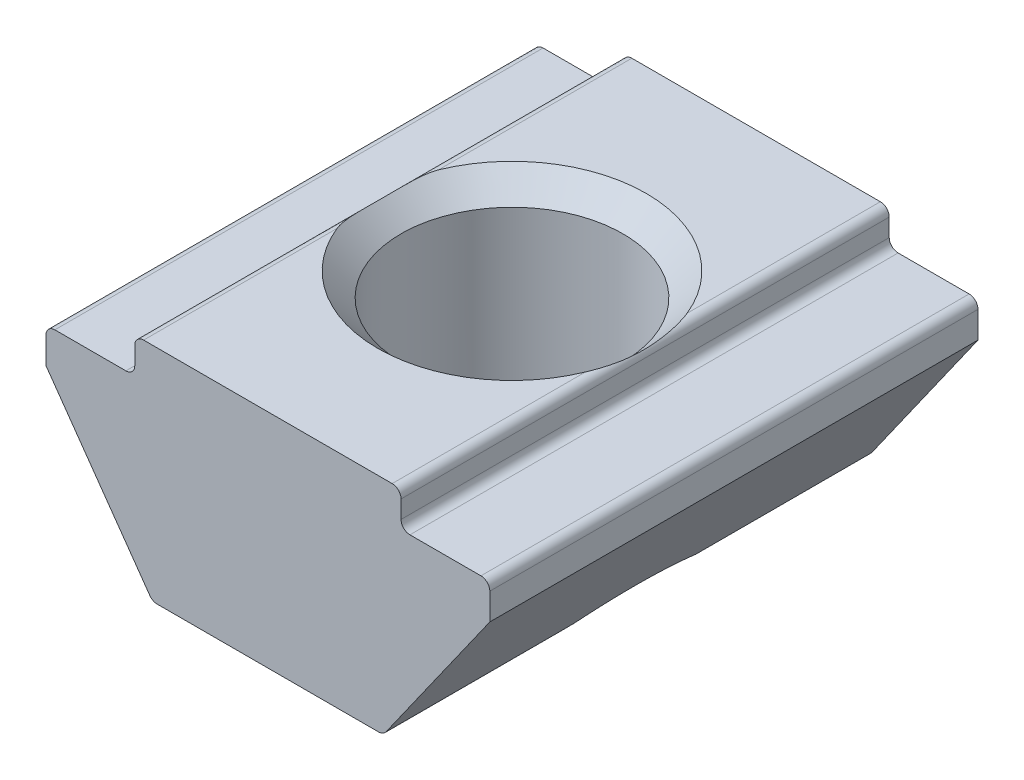
ISO-10303-21;
HEADER;
FILE_DESCRIPTION(('STEP AP214'),'2;1');
FILE_NAME('part.step','',(''),(''),'','','');
FILE_SCHEMA(('AUTOMOTIVE_DESIGN { 1 0 10303 214 1 1 1 1 }'));
ENDSEC;
DATA;
#1=APPLICATION_CONTEXT('core data for automotive mechanical design processes');
#2=APPLICATION_PROTOCOL_DEFINITION('international standard','automotive_design',2000,#1);
#3=PRODUCT_CONTEXT('',#1,'mechanical');
#4=PRODUCT('Part','Part','',(#3));
#5=PRODUCT_RELATED_PRODUCT_CATEGORY('part','',(#4));
#6=PRODUCT_DEFINITION_FORMATION('','',#4);
#7=PRODUCT_DEFINITION_CONTEXT('part definition',#1,'design');
#8=PRODUCT_DEFINITION('design','',#6,#7);
#9=PRODUCT_DEFINITION_SHAPE('','',#8);
#10=(LENGTH_UNIT() NAMED_UNIT(*) SI_UNIT(.MILLI.,.METRE.));
#11=(NAMED_UNIT(*) PLANE_ANGLE_UNIT() SI_UNIT($,.RADIAN.));
#12=(NAMED_UNIT(*) SI_UNIT($,.STERADIAN.) SOLID_ANGLE_UNIT());
#13=UNCERTAINTY_MEASURE_WITH_UNIT(LENGTH_MEASURE(1.E-05),#10,'distance_accuracy_value','');
#14=(GEOMETRIC_REPRESENTATION_CONTEXT(3) GLOBAL_UNCERTAINTY_ASSIGNED_CONTEXT((#13)) GLOBAL_UNIT_ASSIGNED_CONTEXT((#10,
#11,#12)) REPRESENTATION_CONTEXT('',''));
#15=CARTESIAN_POINT('',(0.,0.,0.));
#16=DIRECTION('',(0.,0.,1.));
#17=DIRECTION('',(1.,0.,0.));
#18=AXIS2_PLACEMENT_3D('',#15,#16,#17);
#19=CARTESIAN_POINT('',(-2.6,-5.,5.5));
#20=DIRECTION('',(0.,1.,0.));
#21=DIRECTION('',(0.,0.,1.));
#22=AXIS2_PLACEMENT_3D('',#19,#20,#21);
#23=PLANE('',#22);
#24=DIRECTION('',(0.,0.,-1.));
#25=VECTOR('',#24,1.);
#26=CARTESIAN_POINT('',(2.6,-5.,5.5));
#27=LINE('',#26,#25);
#28=CARTESIAN_POINT('',(2.6,-5.,-1.54616460960662));
#29=VERTEX_POINT('',#28);
#30=CARTESIAN_POINT('',(2.6,-5.,-5.5));
#31=VERTEX_POINT('',#30);
#32=EDGE_CURVE('E191',#29,#31,#27,.T.);
#33=ORIENTED_EDGE('',*,*,#32,.F.);
#34=CARTESIAN_POINT('',(0.,-5.,0.));
#35=DIRECTION('',(0.,1.,0.));
#36=DIRECTION('',(0.,0.,1.));
#37=AXIS2_PLACEMENT_3D('',#34,#35,#36);
#38=CIRCLE('',#37,3.025);
#39=CARTESIAN_POINT('',(-2.6,-5.,-1.54616460960662));
#40=VERTEX_POINT('',#39);
#41=EDGE_CURVE('E200',#29,#40,#38,.T.);
#42=ORIENTED_EDGE('',*,*,#41,.T.);
#43=DIRECTION('',(0.,0.,-1.));
#44=VECTOR('',#43,1.);
#45=CARTESIAN_POINT('',(-2.6,-5.,5.5));
#46=LINE('',#45,#44);
#47=CARTESIAN_POINT('',(-2.6,-5.,-5.5));
#48=VERTEX_POINT('',#47);
#49=EDGE_CURVE('E212',#40,#48,#46,.T.);
#50=ORIENTED_EDGE('',*,*,#49,.T.);
#51=DIRECTION('',(1.,0.,0.));
#52=VECTOR('',#51,1.);
#53=CARTESIAN_POINT('',(-2.6,-5.,-5.5));
#54=LINE('',#53,#52);
#55=EDGE_CURVE('E210',#48,#31,#54,.T.);
#56=ORIENTED_EDGE('',*,*,#55,.T.);
#57=EDGE_LOOP('',(#33,#42,#50,#56));
#58=FACE_BOUND('',#57,.T.);
#59=ADVANCED_FACE('F37',(#58),#23,.F.);
#60=CARTESIAN_POINT('',(3.00000000000001,0.,5.5));
#61=DIRECTION('',(0.,-1.,0.));
#62=DIRECTION('',(0.,0.,-1.));
#63=AXIS2_PLACEMENT_3D('',#60,#61,#62);
#64=PLANE('',#63);
#65=CARTESIAN_POINT('',(0.,0.,0.));
#66=DIRECTION('',(0.,1.,0.));
#67=DIRECTION('',(0.,0.,1.));
#68=AXIS2_PLACEMENT_3D('',#65,#66,#67);
#69=CIRCLE('',#68,3.025);
#70=CARTESIAN_POINT('',(2.8,0.,-1.14482531418552));
#71=VERTEX_POINT('',#70);
#72=CARTESIAN_POINT('',(-2.8,0.,-1.14482531418552));
#73=VERTEX_POINT('',#72);
#74=EDGE_CURVE('E232',#71,#73,#69,.T.);
#75=ORIENTED_EDGE('',*,*,#74,.F.);
#76=DIRECTION('',(0.,0.,-1.));
#77=VECTOR('',#76,1.);
#78=CARTESIAN_POINT('',(2.8,0.,-3.32241265709276));
#79=LINE('',#78,#77);
#80=CARTESIAN_POINT('',(2.8,0.,-5.5));
#81=VERTEX_POINT('',#80);
#82=EDGE_CURVE('E479',#71,#81,#79,.T.);
#83=ORIENTED_EDGE('',*,*,#82,.T.);
#84=DIRECTION('',(-1.,0.,0.));
#85=VECTOR('',#84,1.);
#86=CARTESIAN_POINT('',(3.00000000000001,0.,-5.5));
#87=LINE('',#86,#85);
#88=CARTESIAN_POINT('',(-2.8,0.,-5.5));
#89=VERTEX_POINT('',#88);
#90=EDGE_CURVE('E411',#81,#89,#87,.T.);
#91=ORIENTED_EDGE('',*,*,#90,.T.);
#92=DIRECTION('',(0.,0.,-1.));
#93=VECTOR('',#92,1.);
#94=CARTESIAN_POINT('',(-2.8,0.,-3.32241265709276));
#95=LINE('',#94,#93);
#96=EDGE_CURVE('E52',#89,#73,#95,.F.);
#97=ORIENTED_EDGE('',*,*,#96,.T.);
#98=EDGE_LOOP('',(#75,#83,#91,#97));
#99=FACE_BOUND('',#98,.T.);
#100=ADVANCED_FACE('F320',(#99),#64,.F.);
#101=DIRECTION('',(-1.,0.,0.));
#102=VECTOR('',#101,1.);
#103=CARTESIAN_POINT('',(3.00000000000001,0.,5.5));
#104=LINE('',#103,#102);
#105=CARTESIAN_POINT('',(2.8,0.,5.5));
#106=VERTEX_POINT('',#105);
#107=CARTESIAN_POINT('',(-2.8,0.,5.5));
#108=VERTEX_POINT('',#107);
#109=EDGE_CURVE('E218',#106,#108,#104,.T.);
#110=ORIENTED_EDGE('',*,*,#109,.F.);
#111=DIRECTION('',(0.,0.,-1.));
#112=VECTOR('',#111,1.);
#113=CARTESIAN_POINT('',(2.8,0.,5.5));
#114=LINE('',#113,#112);
#115=CARTESIAN_POINT('',(2.8,0.,1.14482531418552));
#116=VERTEX_POINT('',#115);
#117=EDGE_CURVE('E384',#106,#116,#114,.T.);
#118=ORIENTED_EDGE('',*,*,#117,.T.);
#119=CARTESIAN_POINT('',(-2.8,0.,1.14482531418552));
#120=VERTEX_POINT('',#119);
#121=EDGE_CURVE('E224',#120,#116,#69,.T.);
#122=ORIENTED_EDGE('',*,*,#121,.F.);
#123=DIRECTION('',(0.,0.,-1.));
#124=VECTOR('',#123,1.);
#125=CARTESIAN_POINT('',(-2.80000000000001,0.,5.5));
#126=LINE('',#125,#124);
#127=EDGE_CURVE('E383',#120,#108,#126,.F.);
#128=ORIENTED_EDGE('',*,*,#127,.T.);
#129=EDGE_LOOP('',(#110,#118,#122,#128));
#130=FACE_BOUND('',#129,.T.);
#131=ADVANCED_FACE('F325',(#130),#64,.F.);
#132=CARTESIAN_POINT('',(-3.00000000000001,0.,5.5));
#133=DIRECTION('',(1.,0.,0.));
#134=DIRECTION('',(0.,1.,0.));
#135=AXIS2_PLACEMENT_3D('',#132,#133,#134);
#136=PLANE('',#135);
#137=DIRECTION('',(0.,-1.,0.));
#138=VECTOR('',#137,1.);
#139=CARTESIAN_POINT('',(-3.00000000000001,0.,5.5));
#140=LINE('',#139,#138);
#141=CARTESIAN_POINT('',(-3.,-0.200000000000002,5.5));
#142=VERTEX_POINT('',#141);
#143=CARTESIAN_POINT('',(-3.,-0.599999999999998,5.5));
#144=VERTEX_POINT('',#143);
#145=EDGE_CURVE('E402',#142,#144,#140,.T.);
#146=ORIENTED_EDGE('',*,*,#145,.F.);
#147=DIRECTION('',(0.,0.,-1.));
#148=VECTOR('',#147,1.);
#149=CARTESIAN_POINT('',(-3.,-0.200000000000002,5.5));
#150=LINE('',#149,#148);
#151=CARTESIAN_POINT('',(-3.,-0.200000000000002,-5.5));
#152=VERTEX_POINT('',#151);
#153=EDGE_CURVE('E398',#142,#152,#150,.T.);
#154=ORIENTED_EDGE('',*,*,#153,.T.);
#155=DIRECTION('',(0.,-1.,0.));
#156=VECTOR('',#155,1.);
#157=CARTESIAN_POINT('',(-3.00000000000001,0.,-5.5));
#158=LINE('',#157,#156);
#159=CARTESIAN_POINT('',(-3.,-0.599999999999998,-5.5));
#160=VERTEX_POINT('',#159);
#161=EDGE_CURVE('E196',#152,#160,#158,.T.);
#162=ORIENTED_EDGE('',*,*,#161,.T.);
#163=DIRECTION('',(0.,0.,-1.));
#164=VECTOR('',#163,1.);
#165=CARTESIAN_POINT('',(-3.,-0.599999999999998,5.5));
#166=LINE('',#165,#164);
#167=EDGE_CURVE('E409',#160,#144,#166,.F.);
#168=ORIENTED_EDGE('',*,*,#167,.T.);
#169=EDGE_LOOP('',(#146,#154,#162,#168));
#170=FACE_BOUND('',#169,.T.);
#171=ADVANCED_FACE('F405',(#170),#136,.F.);
#172=CARTESIAN_POINT('',(-3.,-0.799999999999999,5.5));
#173=DIRECTION('',(0.,-1.,0.));
#174=DIRECTION('',(1.,0.,0.));
#175=AXIS2_PLACEMENT_3D('',#172,#173,#174);
#176=PLANE('',#175);
#177=DIRECTION('',(-1.,0.,0.));
#178=VECTOR('',#177,1.);
#179=CARTESIAN_POINT('',(-3.,-0.799999999999999,-5.5));
#180=LINE('',#179,#178);
#181=CARTESIAN_POINT('',(-3.2,-0.799999999999999,-5.5));
#182=VERTEX_POINT('',#181);
#183=CARTESIAN_POINT('',(-4.8,-0.8,-5.5));
#184=VERTEX_POINT('',#183);
#185=EDGE_CURVE('E436',#182,#184,#180,.T.);
#186=ORIENTED_EDGE('',*,*,#185,.T.);
#187=DIRECTION('',(0.,0.,-1.));
#188=VECTOR('',#187,1.);
#189=CARTESIAN_POINT('',(-4.8,-0.8,5.5));
#190=LINE('',#189,#188);
#191=CARTESIAN_POINT('',(-4.8,-0.8,5.5));
#192=VERTEX_POINT('',#191);
#193=EDGE_CURVE('E469',#184,#192,#190,.F.);
#194=ORIENTED_EDGE('',*,*,#193,.T.);
#195=DIRECTION('',(-1.,0.,0.));
#196=VECTOR('',#195,1.);
#197=CARTESIAN_POINT('',(-3.,-0.799999999999999,5.5));
#198=LINE('',#197,#196);
#199=CARTESIAN_POINT('',(-3.2,-0.799999999999999,5.5));
#200=VERTEX_POINT('',#199);
#201=EDGE_CURVE('E410',#200,#192,#198,.T.);
#202=ORIENTED_EDGE('',*,*,#201,.F.);
#203=DIRECTION('',(0.,0.,-1.));
#204=VECTOR('',#203,1.);
#205=CARTESIAN_POINT('',(-3.2,-0.799999999999999,-5.5));
#206=LINE('',#205,#204);
#207=EDGE_CURVE('E472',#200,#182,#206,.T.);
#208=ORIENTED_EDGE('',*,*,#207,.T.);
#209=EDGE_LOOP('',(#186,#194,#202,#208));
#210=FACE_BOUND('',#209,.T.);
#211=ADVANCED_FACE('F487',(#210),#176,.F.);
#212=CARTESIAN_POINT('',(-5.,-0.8,5.5));
#213=DIRECTION('',(1.,0.,0.));
#214=DIRECTION('',(0.,0.,-1.));
#215=AXIS2_PLACEMENT_3D('',#212,#213,#214);
#216=PLANE('',#215);
#217=DIRECTION('',(0.,-1.,0.));
#218=VECTOR('',#217,1.);
#219=CARTESIAN_POINT('',(-5.,-0.8,5.5));
#220=LINE('',#219,#218);
#221=CARTESIAN_POINT('',(-5.,-1.,5.5));
#222=VERTEX_POINT('',#221);
#223=CARTESIAN_POINT('',(-5.,-1.6,5.5));
#224=VERTEX_POINT('',#223);
#225=EDGE_CURVE('E413',#222,#224,#220,.T.);
#226=ORIENTED_EDGE('',*,*,#225,.F.);
#227=DIRECTION('',(0.,0.,-1.));
#228=VECTOR('',#227,1.);
#229=CARTESIAN_POINT('',(-5.,-1.,5.5));
#230=LINE('',#229,#228);
#231=CARTESIAN_POINT('',(-5.,-1.,-5.5));
#232=VERTEX_POINT('',#231);
#233=EDGE_CURVE('E481',#222,#232,#230,.T.);
#234=ORIENTED_EDGE('',*,*,#233,.T.);
#235=DIRECTION('',(0.,-1.,0.));
#236=VECTOR('',#235,1.);
#237=CARTESIAN_POINT('',(-5.,-0.8,-5.5));
#238=LINE('',#237,#236);
#239=CARTESIAN_POINT('',(-5.,-1.6,-5.5));
#240=VERTEX_POINT('',#239);
#241=EDGE_CURVE('E439',#232,#240,#238,.T.);
#242=ORIENTED_EDGE('',*,*,#241,.T.);
#243=DIRECTION('',(0.,0.,-1.));
#244=VECTOR('',#243,1.);
#245=CARTESIAN_POINT('',(-5.,-1.6,5.5));
#246=LINE('',#245,#244);
#247=EDGE_CURVE('E215',#224,#240,#246,.T.);
#248=ORIENTED_EDGE('',*,*,#247,.F.);
#249=EDGE_LOOP('',(#226,#234,#242,#248));
#250=FACE_BOUND('',#249,.T.);
#251=ADVANCED_FACE('F334',(#250),#216,.F.);
#252=CARTESIAN_POINT('',(-5.,-1.6,5.5));
#253=DIRECTION('',(0.816967863264762,0.576683197598655,0.));
#254=DIRECTION('',(-0.576683197598655,0.816967863264762,0.));
#255=AXIS2_PLACEMENT_3D('',#252,#253,#254);
#256=PLANE('',#255);
#257=CARTESIAN_POINT('',(-2.59985882352941,-5.0002,-1.54679317871403));
#258=CARTESIAN_POINT('',(-2.6267544948981,-4.96209779889436,-1.42717586692645));
#259=CARTESIAN_POINT('',(-2.65106063324053,-4.92766410290925,-1.30570465496978));
#260=CARTESIAN_POINT('',(-2.69379040249831,-4.86713026312739,-1.05949900329708));
#261=CARTESIAN_POINT('',(-2.71220483976076,-4.84104314367225,-0.9347597889973));
#262=CARTESIAN_POINT('',(-2.74228718133371,-4.79842649311057,-0.683443476626554));
#263=CARTESIAN_POINT('',(-2.75398708140213,-4.78185163468031,-0.556878091334993));
#264=CARTESIAN_POINT('',(-2.77024575994275,-4.75881850674777,-0.302449653095474));
#265=CARTESIAN_POINT('',(-2.77480959285015,-4.75235307679562,-0.174587583248102));
#266=CARTESIAN_POINT('',(-2.7765415770818,-4.74989943246745,0.0743083555373113));
#267=CARTESIAN_POINT('',(-2.77409937307033,-4.75335922148371,0.195334439174912));
#268=CARTESIAN_POINT('',(-2.76275535657867,-4.76942991151355,0.436502901820788));
#269=CARTESIAN_POINT('',(-2.75385155005708,-4.78204363741913,0.556644996467537));
#270=CARTESIAN_POINT('',(-2.72997372714455,-4.81587055321189,0.794870834225737));
#271=CARTESIAN_POINT('',(-2.71500977733913,-4.8370694821029,0.912957653747817));
#272=CARTESIAN_POINT('',(-2.67956960786266,-4.88727638886124,1.14655284485227));
#273=CARTESIAN_POINT('',(-2.65909589997121,-4.91628080837411,1.26206236544934));
#274=CARTESIAN_POINT('',(-2.63043464065816,-4.95688425906761,1.40471963200574));
#275=CARTESIAN_POINT('',(-2.62452255384269,-4.96525971538953,1.43328611735196));
#276=CARTESIAN_POINT('',(-2.61240756758868,-4.9824226125827,1.49019745769621));
#277=CARTESIAN_POINT('',(-2.60620499470306,-4.99120959083733,1.51854252166359));
#278=CARTESIAN_POINT('',(-2.59985882352941,-5.0002,1.54679317871403));
#279=B_SPLINE_CURVE_WITH_KNOTS('',3,(#257,#258,#259,#260,#261,#262,#263,#264,#265,#266,#267,
#268,#269,#270,#271,#272,#273,#274,#275,#276,#277,#278),.UNSPECIFIED.,.F.,.F.,(4,2,2,2,2,2,2,2,
2,2,4),(0.,0.385217979349971,0.771034169707288,1.15499628892532,1.53868632659678,
1.90145770689503,2.2643410855597,2.62662413017535,2.98874229674041,3.07979112045331,
3.17073993868374),.UNSPECIFIED.);
#280=CARTESIAN_POINT('',(-2.65976237210372,-4.91533663951973,1.25349259177842));
#281=VERTEX_POINT('',#280);
#282=EDGE_CURVE('E203',#40,#281,#279,.T.);
#283=ORIENTED_EDGE('',*,*,#282,.T.);
#284=DIRECTION('',(0.,0.,-1.));
#285=VECTOR('',#284,1.);
#286=CARTESIAN_POINT('',(-2.65976237210372,-4.91533663951973,5.5));
#287=LINE('',#286,#285);
#288=CARTESIAN_POINT('',(-2.65976237210372,-4.91533663951973,5.5));
#289=VERTEX_POINT('',#288);
#290=EDGE_CURVE('E361',#281,#289,#287,.F.);
#291=ORIENTED_EDGE('',*,*,#290,.T.);
#292=DIRECTION('',(0.576683197598655,-0.816967863264762,0.));
#293=VECTOR('',#292,1.);
#294=CARTESIAN_POINT('',(-5.,-1.6,5.5));
#295=LINE('',#294,#293);
#296=EDGE_CURVE('E418',#224,#289,#295,.T.);
#297=ORIENTED_EDGE('',*,*,#296,.F.);
#298=ORIENTED_EDGE('',*,*,#247,.T.);
#299=DIRECTION('',(0.576683197598655,-0.816967863264762,0.));
#300=VECTOR('',#299,1.);
#301=CARTESIAN_POINT('',(-5.,-1.6,-5.5));
#302=LINE('',#301,#300);
#303=EDGE_CURVE('E441',#240,#48,#302,.T.);
#304=ORIENTED_EDGE('',*,*,#303,.T.);
#305=ORIENTED_EDGE('',*,*,#49,.F.);
#306=EDGE_LOOP('',(#283,#291,#297,#298,#304,#305));
#307=FACE_BOUND('',#306,.T.);
#308=ADVANCED_FACE('F234',(#307),#256,.F.);
#309=CARTESIAN_POINT('',(-2.49636879945077,-5.,1.70844017077822));
#310=VERTEX_POINT('',#309);
#311=CARTESIAN_POINT('',(2.49636879945077,-5.,1.70844017077822));
#312=VERTEX_POINT('',#311);
#313=EDGE_CURVE('E207',#310,#312,#38,.T.);
#314=ORIENTED_EDGE('',*,*,#313,.T.);
#315=DIRECTION('',(0.,0.,-1.));
#316=VECTOR('',#315,1.);
#317=CARTESIAN_POINT('',(2.49636879945077,-5.,5.5));
#318=LINE('',#317,#316);
#319=CARTESIAN_POINT('',(2.49636879945077,-5.,5.5));
#320=VERTEX_POINT('',#319);
#321=EDGE_CURVE('E341',#312,#320,#318,.F.);
#322=ORIENTED_EDGE('',*,*,#321,.T.);
#323=DIRECTION('',(1.,0.,0.));
#324=VECTOR('',#323,1.);
#325=CARTESIAN_POINT('',(-2.6,-5.,5.5));
#326=LINE('',#325,#324);
#327=CARTESIAN_POINT('',(-2.49636879945077,-5.,5.5));
#328=VERTEX_POINT('',#327);
#329=EDGE_CURVE('E421',#328,#320,#326,.T.);
#330=ORIENTED_EDGE('',*,*,#329,.F.);
#331=DIRECTION('',(0.,0.,-1.));
#332=VECTOR('',#331,1.);
#333=CARTESIAN_POINT('',(-2.49636879945077,-5.,5.5));
#334=LINE('',#333,#332);
#335=EDGE_CURVE('E344',#328,#310,#334,.T.);
#336=ORIENTED_EDGE('',*,*,#335,.T.);
#337=EDGE_LOOP('',(#314,#322,#330,#336));
#338=FACE_BOUND('',#337,.T.);
#339=ADVANCED_FACE('F321',(#338),#23,.F.);
#340=CARTESIAN_POINT('',(5.,-1.6,5.5));
#341=DIRECTION('',(-0.816967863264762,0.576683197598655,0.));
#342=DIRECTION('',(-0.576683197598655,-0.816967863264762,0.));
#343=AXIS2_PLACEMENT_3D('',#340,#341,#342);
#344=PLANE('',#343);
#345=DIRECTION('',(0.576683197598655,0.816967863264762,0.));
#346=VECTOR('',#345,1.);
#347=CARTESIAN_POINT('',(5.,-1.6,5.5));
#348=LINE('',#347,#346);
#349=CARTESIAN_POINT('',(2.65976237210372,-4.91533663951973,5.5));
#350=VERTEX_POINT('',#349);
#351=CARTESIAN_POINT('',(5.,-1.6,5.5));
#352=VERTEX_POINT('',#351);
#353=EDGE_CURVE('E423',#350,#352,#348,.T.);
#354=ORIENTED_EDGE('',*,*,#353,.F.);
#355=DIRECTION('',(0.,0.,-1.));
#356=VECTOR('',#355,1.);
#357=CARTESIAN_POINT('',(2.65976237210372,-4.91533663951973,5.5));
#358=LINE('',#357,#356);
#359=CARTESIAN_POINT('',(2.65976237210372,-4.91533663951973,1.2534925917784));
#360=VERTEX_POINT('',#359);
#361=EDGE_CURVE('E194',#350,#360,#358,.T.);
#362=ORIENTED_EDGE('',*,*,#361,.T.);
#363=CARTESIAN_POINT('',(2.59985882352941,-5.0002,1.54679317871403));
#364=CARTESIAN_POINT('',(2.6267544948981,-4.96209779889436,1.42717586692645));
#365=CARTESIAN_POINT('',(2.65106063324053,-4.92766410290925,1.30570465496978));
#366=CARTESIAN_POINT('',(2.69379040249831,-4.86713026312739,1.05949900329708));
#367=CARTESIAN_POINT('',(2.71220483976076,-4.84104314367225,0.934759788997298));
#368=CARTESIAN_POINT('',(2.74228718133371,-4.79842649311057,0.683443476626553));
#369=CARTESIAN_POINT('',(2.75398708140213,-4.78185163468031,0.556878091334992));
#370=CARTESIAN_POINT('',(2.77024575994275,-4.75881850674777,0.302449653095473));
#371=CARTESIAN_POINT('',(2.77480959285015,-4.75235307679562,0.174587583248102));
#372=CARTESIAN_POINT('',(2.7765415770818,-4.74989943246745,-0.0743083555373122));
#373=CARTESIAN_POINT('',(2.77409937307033,-4.75335922148371,-0.195334439174913));
#374=CARTESIAN_POINT('',(2.76275535657867,-4.76942991151355,-0.436502901820789));
#375=CARTESIAN_POINT('',(2.75385155005708,-4.78204363741913,-0.556644996467538));
#376=CARTESIAN_POINT('',(2.72997372714455,-4.81587055321189,-0.794870834225738));
#377=CARTESIAN_POINT('',(2.71500977733913,-4.8370694821029,-0.912957653747818));
#378=CARTESIAN_POINT('',(2.67956960786266,-4.88727638886124,-1.14655284485227));
#379=CARTESIAN_POINT('',(2.65909589997121,-4.91628080837411,-1.26206236544934));
#380=CARTESIAN_POINT('',(2.63043464065816,-4.95688425906761,-1.40471963200574));
#381=CARTESIAN_POINT('',(2.62452255384269,-4.96525971538953,-1.43328611735197));
#382=CARTESIAN_POINT('',(2.61240756758868,-4.9824226125827,-1.49019745769621));
#383=CARTESIAN_POINT('',(2.60620499470306,-4.99120959083733,-1.51854252166359));
#384=CARTESIAN_POINT('',(2.59985882352941,-5.0002,-1.54679317871403));
#385=B_SPLINE_CURVE_WITH_KNOTS('',3,(#363,#364,#365,#366,#367,#368,#369,#370,#371,#372,#373,
#374,#375,#376,#377,#378,#379,#380,#381,#382,#383,#384),.UNSPECIFIED.,.F.,.F.,(4,2,2,2,2,2,2,2,
2,2,4),(0.,0.385217979349971,0.771034169707289,1.15499628892532,1.53868632659678,
1.90145770689503,2.2643410855597,2.62662413017535,2.98874229674041,3.07979112045331,
3.17073993868374),.UNSPECIFIED.);
#386=EDGE_CURVE('E186',#360,#29,#385,.T.);
#387=ORIENTED_EDGE('',*,*,#386,.T.);
#388=ORIENTED_EDGE('',*,*,#32,.T.);
#389=DIRECTION('',(0.576683197598655,0.816967863264762,0.));
#390=VECTOR('',#389,1.);
#391=CARTESIAN_POINT('',(5.,-1.6,-5.5));
#392=LINE('',#391,#390);
#393=CARTESIAN_POINT('',(5.,-1.6,-5.5));
#394=VERTEX_POINT('',#393);
#395=EDGE_CURVE('E445',#31,#394,#392,.T.);
#396=ORIENTED_EDGE('',*,*,#395,.T.);
#397=DIRECTION('',(0.,0.,-1.));
#398=VECTOR('',#397,1.);
#399=CARTESIAN_POINT('',(5.,-1.6,5.5));
#400=LINE('',#399,#398);
#401=EDGE_CURVE('E213',#352,#394,#400,.T.);
#402=ORIENTED_EDGE('',*,*,#401,.F.);
#403=EDGE_LOOP('',(#354,#362,#387,#388,#396,#402));
#404=FACE_BOUND('',#403,.T.);
#405=ADVANCED_FACE('F189',(#404),#344,.F.);
#406=CARTESIAN_POINT('',(5.,-0.8,5.5));
#407=DIRECTION('',(-1.,0.,0.));
#408=DIRECTION('',(0.,0.,1.));
#409=AXIS2_PLACEMENT_3D('',#406,#407,#408);
#410=PLANE('',#409);
#411=DIRECTION('',(0.,1.,0.));
#412=VECTOR('',#411,1.);
#413=CARTESIAN_POINT('',(5.,-0.8,-5.5));
#414=LINE('',#413,#412);
#415=CARTESIAN_POINT('',(5.,-1.,-5.5));
#416=VERTEX_POINT('',#415);
#417=EDGE_CURVE('E447',#394,#416,#414,.T.);
#418=ORIENTED_EDGE('',*,*,#417,.T.);
#419=DIRECTION('',(0.,0.,-1.));
#420=VECTOR('',#419,1.);
#421=CARTESIAN_POINT('',(5.,-1.,5.5));
#422=LINE('',#421,#420);
#423=CARTESIAN_POINT('',(5.,-1.,5.5));
#424=VERTEX_POINT('',#423);
#425=EDGE_CURVE('E376',#416,#424,#422,.F.);
#426=ORIENTED_EDGE('',*,*,#425,.T.);
#427=DIRECTION('',(0.,1.,0.));
#428=VECTOR('',#427,1.);
#429=CARTESIAN_POINT('',(5.,-0.8,5.5));
#430=LINE('',#429,#428);
#431=EDGE_CURVE('E425',#352,#424,#430,.T.);
#432=ORIENTED_EDGE('',*,*,#431,.F.);
#433=ORIENTED_EDGE('',*,*,#401,.T.);
#434=EDGE_LOOP('',(#418,#426,#432,#433));
#435=FACE_BOUND('',#434,.T.);
#436=ADVANCED_FACE('F333',(#435),#410,.F.);
#437=CARTESIAN_POINT('',(3.,-0.799999999999999,5.5));
#438=DIRECTION('',(0.,-1.,0.));
#439=DIRECTION('',(1.,0.,0.));
#440=AXIS2_PLACEMENT_3D('',#437,#438,#439);
#441=PLANE('',#440);
#442=DIRECTION('',(-1.,0.,0.));
#443=VECTOR('',#442,1.);
#444=CARTESIAN_POINT('',(3.,-0.799999999999999,5.5));
#445=LINE('',#444,#443);
#446=CARTESIAN_POINT('',(4.8,-0.8,5.5));
#447=VERTEX_POINT('',#446);
#448=CARTESIAN_POINT('',(3.2,-0.799999999999999,5.5));
#449=VERTEX_POINT('',#448);
#450=EDGE_CURVE('E428',#447,#449,#445,.T.);
#451=ORIENTED_EDGE('',*,*,#450,.F.);
#452=DIRECTION('',(0.,0.,-1.));
#453=VECTOR('',#452,1.);
#454=CARTESIAN_POINT('',(4.8,-0.8,5.5));
#455=LINE('',#454,#453);
#456=CARTESIAN_POINT('',(4.8,-0.8,-5.5));
#457=VERTEX_POINT('',#456);
#458=EDGE_CURVE('E365',#447,#457,#455,.T.);
#459=ORIENTED_EDGE('',*,*,#458,.T.);
#460=DIRECTION('',(-1.,0.,0.));
#461=VECTOR('',#460,1.);
#462=CARTESIAN_POINT('',(3.,-0.799999999999999,-5.5));
#463=LINE('',#462,#461);
#464=CARTESIAN_POINT('',(3.2,-0.799999999999999,-5.5));
#465=VERTEX_POINT('',#464);
#466=EDGE_CURVE('E450',#457,#465,#463,.T.);
#467=ORIENTED_EDGE('',*,*,#466,.T.);
#468=DIRECTION('',(0.,0.,-1.));
#469=VECTOR('',#468,1.);
#470=CARTESIAN_POINT('',(3.2,-0.799999999999999,5.5));
#471=LINE('',#470,#469);
#472=EDGE_CURVE('E363',#465,#449,#471,.F.);
#473=ORIENTED_EDGE('',*,*,#472,.T.);
#474=EDGE_LOOP('',(#451,#459,#467,#473));
#475=FACE_BOUND('',#474,.T.);
#476=ADVANCED_FACE('F510',(#475),#441,.F.);
#477=CARTESIAN_POINT('',(3.00000000000001,0.,5.5));
#478=DIRECTION('',(-1.,0.,0.));
#479=DIRECTION('',(0.,-1.,0.));
#480=AXIS2_PLACEMENT_3D('',#477,#478,#479);
#481=PLANE('',#480);
#482=DIRECTION('',(0.,1.,0.));
#483=VECTOR('',#482,1.);
#484=CARTESIAN_POINT('',(3.00000000000001,0.,5.5));
#485=LINE('',#484,#483);
#486=CARTESIAN_POINT('',(3.,-0.599999999999998,5.5));
#487=VERTEX_POINT('',#486);
#488=CARTESIAN_POINT('',(3.,-0.200000000000002,5.5));
#489=VERTEX_POINT('',#488);
#490=EDGE_CURVE('E431',#487,#489,#485,.T.);
#491=ORIENTED_EDGE('',*,*,#490,.F.);
#492=DIRECTION('',(0.,0.,-1.));
#493=VECTOR('',#492,1.);
#494=CARTESIAN_POINT('',(3.,-0.599999999999998,-5.5));
#495=LINE('',#494,#493);
#496=CARTESIAN_POINT('',(3.,-0.599999999999998,-5.5));
#497=VERTEX_POINT('',#496);
#498=EDGE_CURVE('E380',#487,#497,#495,.T.);
#499=ORIENTED_EDGE('',*,*,#498,.T.);
#500=DIRECTION('',(0.,1.,0.));
#501=VECTOR('',#500,1.);
#502=CARTESIAN_POINT('',(3.00000000000001,0.,-5.5));
#503=LINE('',#502,#501);
#504=CARTESIAN_POINT('',(3.,-0.200000000000002,-5.5));
#505=VERTEX_POINT('',#504);
#506=EDGE_CURVE('E415',#497,#505,#503,.T.);
#507=ORIENTED_EDGE('',*,*,#506,.T.);
#508=DIRECTION('',(0.,0.,-1.));
#509=VECTOR('',#508,1.);
#510=CARTESIAN_POINT('',(3.,-0.200000000000002,5.5));
#511=LINE('',#510,#509);
#512=EDGE_CURVE('E378',#505,#489,#511,.F.);
#513=ORIENTED_EDGE('',*,*,#512,.T.);
#514=EDGE_LOOP('',(#491,#499,#507,#513));
#515=FACE_BOUND('',#514,.T.);
#516=ADVANCED_FACE('F458',(#515),#481,.F.);
#517=CARTESIAN_POINT('',(0.,0.,5.5));
#518=DIRECTION('',(0.,0.,-1.));
#519=DIRECTION('',(-1.,0.,0.));
#520=AXIS2_PLACEMENT_3D('',#517,#518,#519);
#521=PLANE('',#520);
#522=ORIENTED_EDGE('',*,*,#329,.T.);
#523=CARTESIAN_POINT('',(2.49636879945077,-4.8,5.5));
#524=DIRECTION('',(0.,0.,-1.));
#525=DIRECTION('',(-1.,0.,0.));
#526=AXIS2_PLACEMENT_3D('',#523,#524,#525);
#527=CIRCLE('',#526,0.2);
#528=EDGE_CURVE('E347',#320,#350,#527,.F.);
#529=ORIENTED_EDGE('',*,*,#528,.T.);
#530=ORIENTED_EDGE('',*,*,#353,.T.);
#531=ORIENTED_EDGE('',*,*,#431,.T.);
#532=CARTESIAN_POINT('',(4.8,-1.,5.5));
#533=DIRECTION('',(0.,0.,-1.));
#534=DIRECTION('',(-1.,0.,0.));
#535=AXIS2_PLACEMENT_3D('',#532,#533,#534);
#536=CIRCLE('',#535,0.2);
#537=EDGE_CURVE('E356',#424,#447,#536,.F.);
#538=ORIENTED_EDGE('',*,*,#537,.T.);
#539=ORIENTED_EDGE('',*,*,#450,.T.);
#540=CARTESIAN_POINT('',(3.2,-0.6,5.5));
#541=DIRECTION('',(0.,0.,-1.));
#542=DIRECTION('',(-1.,0.,0.));
#543=AXIS2_PLACEMENT_3D('',#540,#541,#542);
#544=CIRCLE('',#543,0.2);
#545=EDGE_CURVE('E465',#449,#487,#544,.T.);
#546=ORIENTED_EDGE('',*,*,#545,.T.);
#547=ORIENTED_EDGE('',*,*,#490,.T.);
#548=CARTESIAN_POINT('',(2.8,-0.2,5.5));
#549=DIRECTION('',(0.,0.,-1.));
#550=DIRECTION('',(-1.,0.,0.));
#551=AXIS2_PLACEMENT_3D('',#548,#549,#550);
#552=CIRCLE('',#551,0.2);
#553=EDGE_CURVE('E354',#489,#106,#552,.F.);
#554=ORIENTED_EDGE('',*,*,#553,.T.);
#555=ORIENTED_EDGE('',*,*,#109,.T.);
#556=CARTESIAN_POINT('',(-2.8,-0.2,5.5));
#557=DIRECTION('',(0.,0.,-1.));
#558=DIRECTION('',(-1.,0.,0.));
#559=AXIS2_PLACEMENT_3D('',#556,#557,#558);
#560=CIRCLE('',#559,0.2);
#561=EDGE_CURVE('E350',#108,#142,#560,.F.);
#562=ORIENTED_EDGE('',*,*,#561,.T.);
#563=ORIENTED_EDGE('',*,*,#145,.T.);
#564=CARTESIAN_POINT('',(-3.2,-0.6,5.5));
#565=DIRECTION('',(0.,0.,-1.));
#566=DIRECTION('',(-1.,0.,0.));
#567=AXIS2_PLACEMENT_3D('',#564,#565,#566);
#568=CIRCLE('',#567,0.2);
#569=EDGE_CURVE('E11',#144,#200,#568,.T.);
#570=ORIENTED_EDGE('',*,*,#569,.T.);
#571=ORIENTED_EDGE('',*,*,#201,.T.);
#572=CARTESIAN_POINT('',(-4.8,-1.,5.5));
#573=DIRECTION('',(0.,0.,-1.));
#574=DIRECTION('',(-1.,0.,0.));
#575=AXIS2_PLACEMENT_3D('',#572,#573,#574);
#576=CIRCLE('',#575,0.2);
#577=EDGE_CURVE('E348',#192,#222,#576,.F.);
#578=ORIENTED_EDGE('',*,*,#577,.T.);
#579=ORIENTED_EDGE('',*,*,#225,.T.);
#580=ORIENTED_EDGE('',*,*,#296,.T.);
#581=CARTESIAN_POINT('',(-2.49636879945077,-4.8,5.5));
#582=DIRECTION('',(0.,0.,-1.));
#583=DIRECTION('',(-1.,0.,0.));
#584=AXIS2_PLACEMENT_3D('',#581,#582,#583);
#585=CIRCLE('',#584,0.2);
#586=EDGE_CURVE('E358',#289,#328,#585,.F.);
#587=ORIENTED_EDGE('',*,*,#586,.T.);
#588=EDGE_LOOP('',(#522,#529,#530,#531,#538,#539,#546,#547,#554,#555,#562,#563,#570,#571,#578,
#579,#580,#587));
#589=FACE_BOUND('',#588,.T.);
#590=ADVANCED_FACE('F247',(#589),#521,.F.);
#591=CARTESIAN_POINT('',(0.,0.,-5.5));
#592=DIRECTION('',(0.,0.,-1.));
#593=DIRECTION('',(-1.,0.,0.));
#594=AXIS2_PLACEMENT_3D('',#591,#592,#593);
#595=PLANE('',#594);
#596=ORIENTED_EDGE('',*,*,#466,.F.);
#597=CARTESIAN_POINT('',(4.8,-1.,-5.5));
#598=DIRECTION('',(0.,0.,-1.));
#599=DIRECTION('',(-1.,0.,0.));
#600=AXIS2_PLACEMENT_3D('',#597,#598,#599);
#601=CIRCLE('',#600,0.2);
#602=EDGE_CURVE('E374',#457,#416,#601,.T.);
#603=ORIENTED_EDGE('',*,*,#602,.T.);
#604=ORIENTED_EDGE('',*,*,#417,.F.);
#605=ORIENTED_EDGE('',*,*,#395,.F.);
#606=ORIENTED_EDGE('',*,*,#55,.F.);
#607=ORIENTED_EDGE('',*,*,#303,.F.);
#608=ORIENTED_EDGE('',*,*,#241,.F.);
#609=CARTESIAN_POINT('',(-4.8,-1.,-5.5));
#610=DIRECTION('',(0.,0.,-1.));
#611=DIRECTION('',(-1.,0.,0.));
#612=AXIS2_PLACEMENT_3D('',#609,#610,#611);
#613=CIRCLE('',#612,0.2);
#614=EDGE_CURVE('E368',#232,#184,#613,.T.);
#615=ORIENTED_EDGE('',*,*,#614,.T.);
#616=ORIENTED_EDGE('',*,*,#185,.F.);
#617=CARTESIAN_POINT('',(-3.2,-0.6,-5.5));
#618=DIRECTION('',(0.,0.,-1.));
#619=DIRECTION('',(-1.,0.,0.));
#620=AXIS2_PLACEMENT_3D('',#617,#618,#619);
#621=CIRCLE('',#620,0.2);
#622=EDGE_CURVE('E45',#182,#160,#621,.F.);
#623=ORIENTED_EDGE('',*,*,#622,.T.);
#624=ORIENTED_EDGE('',*,*,#161,.F.);
#625=CARTESIAN_POINT('',(-2.8,-0.2,-5.5));
#626=DIRECTION('',(0.,0.,-1.));
#627=DIRECTION('',(-1.,0.,0.));
#628=AXIS2_PLACEMENT_3D('',#625,#626,#627);
#629=CIRCLE('',#628,0.2);
#630=EDGE_CURVE('E370',#152,#89,#629,.T.);
#631=ORIENTED_EDGE('',*,*,#630,.T.);
#632=ORIENTED_EDGE('',*,*,#90,.F.);
#633=CARTESIAN_POINT('',(2.8,-0.2,-5.5));
#634=DIRECTION('',(0.,0.,-1.));
#635=DIRECTION('',(-1.,0.,0.));
#636=AXIS2_PLACEMENT_3D('',#633,#634,#635);
#637=CIRCLE('',#636,0.2);
#638=EDGE_CURVE('E372',#81,#505,#637,.T.);
#639=ORIENTED_EDGE('',*,*,#638,.T.);
#640=ORIENTED_EDGE('',*,*,#506,.F.);
#641=CARTESIAN_POINT('',(3.2,-0.6,-5.5));
#642=DIRECTION('',(0.,0.,-1.));
#643=DIRECTION('',(-1.,0.,0.));
#644=AXIS2_PLACEMENT_3D('',#641,#642,#643);
#645=CIRCLE('',#644,0.2);
#646=EDGE_CURVE('E467',#497,#465,#645,.F.);
#647=ORIENTED_EDGE('',*,*,#646,.T.);
#648=EDGE_LOOP('',(#596,#603,#604,#605,#606,#607,#608,#615,#616,#623,#624,#631,#632,#639,#640,#647));
#649=FACE_BOUND('',#648,.T.);
#650=ADVANCED_FACE('F243',(#649),#595,.T.);
#651=CARTESIAN_POINT('',(0.,-4.475,0.));
#652=DIRECTION('',(0.,-1.,0.));
#653=DIRECTION('',(0.,0.,-1.));
#654=AXIS2_PLACEMENT_3D('',#651,#652,#653);
#655=CONICAL_SURFACE('',#654,2.5,0.785398163397445);
#656=CARTESIAN_POINT('',(0.,-4.475,0.));
#657=DIRECTION('',(0.,1.,0.));
#658=DIRECTION('',(0.,0.,1.));
#659=AXIS2_PLACEMENT_3D('',#656,#657,#658);
#660=CIRCLE('',#659,2.5);
#661=CARTESIAN_POINT('',(0.,-4.475,2.5));
#662=VERTEX_POINT('',#661);
#663=EDGE_CURVE('E197',#662,#662,#660,.T.);
#664=ORIENTED_EDGE('',*,*,#663,.T.);
#665=EDGE_LOOP('',(#664));
#666=FACE_BOUND('',#665,.T.);
#667=ORIENTED_EDGE('',*,*,#386,.F.);
#668=CARTESIAN_POINT('',(2.65976237210372,-4.91533663951973,1.2534925917784));
#669=CARTESIAN_POINT('',(2.65377525457936,-4.92376325233253,1.28595929829737));
#670=CARTESIAN_POINT('',(2.64702136041576,-4.93198798479863,1.31836716805391));
#671=CARTESIAN_POINT('',(2.63160398893161,-4.94777666295759,1.38315523524901));
#672=CARTESIAN_POINT('',(2.62292657458625,-4.95533519225161,1.41553340360652));
#673=CARTESIAN_POINT('',(2.60365708555706,-4.96918937593576,1.47890402350194));
#674=CARTESIAN_POINT('',(2.59312963369771,-4.97551590493667,1.50990904749842));
#675=CARTESIAN_POINT('',(2.56950238960896,-4.98661096594242,1.57114598653542));
#676=CARTESIAN_POINT('',(2.55641115105541,-4.99138454191732,1.60138010448627));
#677=CARTESIAN_POINT('',(2.53487611407219,-4.99637703457064,1.64418394238469));
#678=CARTESIAN_POINT('',(2.52783494963422,-4.99765710511688,1.65732545650764));
#679=CARTESIAN_POINT('',(2.51283080591201,-4.99946110426573,1.68323249030378));
#680=CARTESIAN_POINT('',(2.50486223933467,-4.99998016333635,1.69599508097044));
#681=CARTESIAN_POINT('',(2.49636879945077,-5.,1.70844017077823));
#682=B_SPLINE_CURVE_WITH_KNOTS('',3,(#668,#669,#670,#671,#672,#673,#674,#675,#676,#677,#678,
#679,#680,#681),.UNSPECIFIED.,.F.,.F.,(4,2,2,2,2,2,4),(0.,0.102253213499984,0.205273046629004,
0.3052288184254,0.404856616433118,0.449703159779905,0.494835431721414),.UNSPECIFIED.);
#683=EDGE_CURVE('E266',#360,#312,#682,.T.);
#684=ORIENTED_EDGE('',*,*,#683,.T.);
#685=ORIENTED_EDGE('',*,*,#313,.F.);
#686=CARTESIAN_POINT('',(-2.49636879945077,-5.,1.70844017077822));
#687=CARTESIAN_POINT('',(-2.50505792363599,-4.99997617910823,1.69570226769145));
#688=CARTESIAN_POINT('',(-2.51320248870796,-4.99943454522257,1.68263295843736));
#689=CARTESIAN_POINT('',(-2.52854867029654,-4.99755117126572,1.65604664759234));
#690=CARTESIAN_POINT('',(-2.53575262995956,-4.99621146749521,1.64253086780148));
#691=CARTESIAN_POINT('',(-2.54933835823215,-4.99298112236259,1.61533604081087));
#692=CARTESIAN_POINT('',(-2.55572758958412,-4.99109609133841,1.60165995313152));
#693=CARTESIAN_POINT('',(-2.56787331733373,-4.98689173309811,1.57408420506519));
#694=CARTESIAN_POINT('',(-2.57362931977273,-4.98457207060143,1.56018437970181));
#695=CARTESIAN_POINT('',(-2.58836877586662,-4.97787569301365,1.52257548929373));
#696=CARTESIAN_POINT('',(-2.59683632927875,-4.97318458757814,1.49872054379561));
#697=CARTESIAN_POINT('',(-2.61245326536369,-4.9631266274667,1.45072412987541));
#698=CARTESIAN_POINT('',(-2.61960222314957,-4.95775955591056,1.42658257175687));
#699=CARTESIAN_POINT('',(-2.63287723831598,-4.94643478420515,1.37768024384351));
#700=CARTESIAN_POINT('',(-2.63898304089935,-4.94046833975061,1.35291606077752));
#701=CARTESIAN_POINT('',(-2.65013333830425,-4.92815709053856,1.30327951176734));
#702=CARTESIAN_POINT('',(-2.65517926808219,-4.9218128124711,1.27840733923833));
#703=CARTESIAN_POINT('',(-2.65976237210372,-4.91533663951974,1.25349259177844));
#704=B_SPLINE_CURVE_WITH_KNOTS('',3,(#686,#687,#688,#689,#690,#691,#692,#693,#694,#695,#696,
#697,#698,#699,#700,#701,#702,#703),.UNSPECIFIED.,.F.,.F.,(4,2,2,2,2,2,2,2,4),(0.,
0.0461897942717069,0.0922622355960274,0.13787658517795,0.183526268244054,0.260697535707544,
0.33789362654912,0.416450626717764,0.494900573465257),.UNSPECIFIED.);
#705=EDGE_CURVE('E260',#310,#281,#704,.T.);
#706=ORIENTED_EDGE('',*,*,#705,.T.);
#707=ORIENTED_EDGE('',*,*,#282,.F.);
#708=ORIENTED_EDGE('',*,*,#41,.F.);
#709=EDGE_LOOP('',(#667,#684,#685,#706,#707,#708));
#710=FACE_BOUND('',#709,.T.);
#711=ADVANCED_FACE('F201',(#666,#710),#655,.F.);
#712=CARTESIAN_POINT('',(0.,0.,0.));
#713=DIRECTION('',(0.,1.,0.));
#714=DIRECTION('',(0.,0.,1.));
#715=AXIS2_PLACEMENT_3D('',#712,#713,#714);
#716=CONICAL_SURFACE('',#715,3.025,0.78539816339745);
#717=CARTESIAN_POINT('',(0.,-0.524999999999999,0.));
#718=DIRECTION('',(0.,1.,0.));
#719=DIRECTION('',(0.,0.,1.));
#720=AXIS2_PLACEMENT_3D('',#717,#718,#719);
#721=CIRCLE('',#720,2.5);
#722=CARTESIAN_POINT('',(0.,-0.524999999999999,2.5));
#723=VERTEX_POINT('',#722);
#724=EDGE_CURVE('E206',#723,#723,#721,.T.);
#725=ORIENTED_EDGE('',*,*,#724,.F.);
#726=EDGE_LOOP('',(#725));
#727=FACE_BOUND('',#726,.T.);
#728=ORIENTED_EDGE('',*,*,#121,.T.);
#729=CARTESIAN_POINT('',(2.8,0.,1.14482531418552));
#730=CARTESIAN_POINT('',(2.80639945180235,-1.09730467170497E-05,1.12914492417643));
#731=CARTESIAN_POINT('',(2.81239921429586,-0.000306358672918429,1.11331421147813));
#732=CARTESIAN_POINT('',(2.82371657732814,-0.00132741785319993,1.08143697195949));
#733=CARTESIAN_POINT('',(2.82903471485729,-0.00205275012557939,1.06539062616643));
#734=CARTESIAN_POINT('',(2.84413008387627,-0.00466251521411275,1.01710150190553));
#735=CARTESIAN_POINT('',(2.85308031550817,-0.00698221589140219,0.984626239884385));
#736=CARTESIAN_POINT('',(2.86931699146583,-0.0122043148311794,0.919285566029558));
#737=CARTESIAN_POINT('',(2.876601595417,-0.0151073510410321,0.88641976444376));
#738=CARTESIAN_POINT('',(2.88982743786315,-0.0211600872597968,0.820412250830919));
#739=CARTESIAN_POINT('',(2.89576739022701,-0.0243100195762292,0.787270305822148));
#740=CARTESIAN_POINT('',(2.91018349426315,-0.0327571934127854,0.698225223568421));
#741=CARTESIAN_POINT('',(2.91764042398295,-0.038059154369495,0.642158055051629));
#742=CARTESIAN_POINT('',(2.93012681261877,-0.0479163301197032,0.529680998895915));
#743=CARTESIAN_POINT('',(2.93515552207519,-0.0524713140759095,0.473271010879999));
#744=CARTESIAN_POINT('',(2.94325628255238,-0.060323414143965,0.360204307451291));
#745=CARTESIAN_POINT('',(2.94632766868102,-0.0636201026673143,0.303547514773508));
#746=CARTESIAN_POINT('',(2.95082081414282,-0.0686061508943738,0.190097991231332));
#747=CARTESIAN_POINT('',(2.95224257169803,-0.0702955088657258,0.133305260220493));
#748=CARTESIAN_POINT('',(2.95358998943993,-0.071893621130099,0.0195706570818825));
#749=CARTESIAN_POINT('',(2.95351285185935,-0.0717990456263187,-0.0373712955474137));
#750=CARTESIAN_POINT('',(2.95184724093865,-0.0698306506083424,-0.151207125447712));
#751=CARTESIAN_POINT('',(2.95025863539901,-0.0679566754601821,-0.208100998077762));
#752=CARTESIAN_POINT('',(2.94539953076735,-0.062624971798498,-0.321737111554035));
#753=CARTESIAN_POINT('',(2.94212917366853,-0.0591673769954159,-0.378479364795243));
#754=CARTESIAN_POINT('',(2.93358121870669,-0.0510330725062621,-0.491719511910587));
#755=CARTESIAN_POINT('',(2.92830392399103,-0.0463565469728746,-0.54821744138688));
#756=CARTESIAN_POINT('',(2.91643290223477,-0.0372476558504291,-0.650547379707056));
#757=CARTESIAN_POINT('',(2.91025725394915,-0.0329274201374148,-0.696437834769374));
#758=CARTESIAN_POINT('',(2.89584061235384,-0.0242553294208928,-0.787841844994367));
#759=CARTESIAN_POINT('',(2.88760228091243,-0.0199035221346982,-0.83335580841202));
#760=CARTESIAN_POINT('',(2.873252478928,-0.0138264944006265,-0.901173392581692));
#761=CARTESIAN_POINT('',(2.8681464896197,-0.0118785705110041,-0.923669612714074));
#762=CARTESIAN_POINT('',(2.85715380057764,-0.00825324529144349,-0.96848442589956));
#763=CARTESIAN_POINT('',(2.85126740611561,-0.00657573874780344,-0.99080308480923));
#764=CARTESIAN_POINT('',(2.83854485890004,-0.00363743982956065,-1.03529198736695));
#765=CARTESIAN_POINT('',(2.83170534040794,-0.00237818018927367,-1.0574613996548));
#766=CARTESIAN_POINT('',(2.81682162942816,-0.000576326432006168,-1.10145088954272));
#767=CARTESIAN_POINT('',(2.80877581436209,-3.47074102958318E-05,-1.12327045212319));
#768=CARTESIAN_POINT('',(2.80000000000001,0.,-1.14482531418552));
#769=B_SPLINE_CURVE_WITH_KNOTS('',3,(#729,#730,#731,#732,#733,#734,#735,#736,#737,#738,#739,
#740,#741,#742,#743,#744,#745,#746,#747,#748,#749,#750,#751,#752,#753,#754,#755,#756,#757,#758,
#759,#760,#761,#762,#763,#764,#765,#766,#767,#768),.UNSPECIFIED.,.F.,.F.,(4,2,2,2,2,2,2,2,2,2,2,
2,2,2,2,2,2,2,2,4),(0.,0.0507829915990835,0.101525726713421,0.202746786236499,0.304079151573027,
0.405508033486999,0.575857347678295,0.746259205888947,0.916718917876172,1.08717881358225,
1.2579569122351,1.42874994925276,1.59952856828587,1.77028140149703,1.90976332257761,
2.04906616336496,2.11850538138256,2.18791751650914,2.2575812871288,2.32733961676369),.UNSPECIFIED.);
#770=EDGE_CURVE('E59',#116,#71,#769,.T.);
#771=ORIENTED_EDGE('',*,*,#770,.T.);
#772=ORIENTED_EDGE('',*,*,#74,.T.);
#773=CARTESIAN_POINT('',(-2.8,0.,-1.14482531418552));
#774=CARTESIAN_POINT('',(-2.80639945180235,-1.09730467170497E-05,-1.12914492417643));
#775=CARTESIAN_POINT('',(-2.81239921429586,-0.000306358672918429,-1.11331421147813));
#776=CARTESIAN_POINT('',(-2.82371657732814,-0.00132741785319993,-1.08143697195949));
#777=CARTESIAN_POINT('',(-2.82903471485729,-0.00205275012557939,-1.06539062616643));
#778=CARTESIAN_POINT('',(-2.84413008387627,-0.00466251521411275,-1.01710150190553));
#779=CARTESIAN_POINT('',(-2.85308031550817,-0.00698221589140219,-0.984626239884385));
#780=CARTESIAN_POINT('',(-2.86931699146583,-0.0122043148311794,-0.919285566029558));
#781=CARTESIAN_POINT('',(-2.876601595417,-0.0151073510410321,-0.88641976444376));
#782=CARTESIAN_POINT('',(-2.88982743786315,-0.0211600872597968,-0.820412250830919));
#783=CARTESIAN_POINT('',(-2.89576739022701,-0.0243100195762292,-0.787270305822148));
#784=CARTESIAN_POINT('',(-2.91018349426315,-0.0327571934127854,-0.698225223568421));
#785=CARTESIAN_POINT('',(-2.91764042398295,-0.038059154369495,-0.642158055051629));
#786=CARTESIAN_POINT('',(-2.93012681261877,-0.0479163301197032,-0.529680998895915));
#787=CARTESIAN_POINT('',(-2.93515552207519,-0.0524713140759095,-0.473271010879999));
#788=CARTESIAN_POINT('',(-2.94325628255238,-0.060323414143965,-0.360204307451291));
#789=CARTESIAN_POINT('',(-2.94632766868102,-0.0636201026673143,-0.303547514773508));
#790=CARTESIAN_POINT('',(-2.95082081414282,-0.0686061508943738,-0.190097991231332));
#791=CARTESIAN_POINT('',(-2.95224257169803,-0.0702955088657258,-0.133305260220493));
#792=CARTESIAN_POINT('',(-2.95358998943993,-0.071893621130099,-0.0195706570818825));
#793=CARTESIAN_POINT('',(-2.95351285185935,-0.0717990456263187,0.0373712955474137));
#794=CARTESIAN_POINT('',(-2.95184724093865,-0.0698306506083424,0.151207125447712));
#795=CARTESIAN_POINT('',(-2.95025863539901,-0.0679566754601821,0.208100998077762));
#796=CARTESIAN_POINT('',(-2.94539953076735,-0.062624971798498,0.321737111554035));
#797=CARTESIAN_POINT('',(-2.94212917366853,-0.0591673769954159,0.378479364795243));
#798=CARTESIAN_POINT('',(-2.93358121870669,-0.0510330725062621,0.491719511910587));
#799=CARTESIAN_POINT('',(-2.92830392399103,-0.0463565469728746,0.54821744138688));
#800=CARTESIAN_POINT('',(-2.91643290223477,-0.0372476558504291,0.650547379707056));
#801=CARTESIAN_POINT('',(-2.91025725394915,-0.0329274201374148,0.696437834769374));
#802=CARTESIAN_POINT('',(-2.89584061235384,-0.0242553294208928,0.787841844994367));
#803=CARTESIAN_POINT('',(-2.88760228091243,-0.0199035221346982,0.83335580841202));
#804=CARTESIAN_POINT('',(-2.873252478928,-0.0138264944006265,0.901173392581692));
#805=CARTESIAN_POINT('',(-2.8681464896197,-0.0118785705110041,0.923669612714074));
#806=CARTESIAN_POINT('',(-2.85715380057764,-0.00825324529144349,0.96848442589956));
#807=CARTESIAN_POINT('',(-2.85126740611561,-0.00657573874780344,0.99080308480923));
#808=CARTESIAN_POINT('',(-2.83854485890004,-0.00363743982956065,1.03529198736695));
#809=CARTESIAN_POINT('',(-2.83170534040794,-0.00237818018927367,1.0574613996548));
#810=CARTESIAN_POINT('',(-2.81682162942816,-0.000576326432006168,1.10145088954272));
#811=CARTESIAN_POINT('',(-2.80877581436209,-3.47074102958318E-05,1.12327045212319));
#812=CARTESIAN_POINT('',(-2.80000000000001,0.,1.14482531418552));
#813=B_SPLINE_CURVE_WITH_KNOTS('',3,(#773,#774,#775,#776,#777,#778,#779,#780,#781,#782,#783,
#784,#785,#786,#787,#788,#789,#790,#791,#792,#793,#794,#795,#796,#797,#798,#799,#800,#801,#802,
#803,#804,#805,#806,#807,#808,#809,#810,#811,#812),.UNSPECIFIED.,.F.,.F.,(4,2,2,2,2,2,2,2,2,2,2,
2,2,2,2,2,2,2,2,4),(0.,0.0507829915990835,0.101525726713421,0.202746786236499,0.304079151573027,
0.405508033486999,0.575857347678295,0.746259205888947,0.916718917876172,1.08717881358225,
1.2579569122351,1.42874994925276,1.59952856828587,1.77028140149703,1.90976332257761,
2.04906616336496,2.11850538138256,2.18791751650914,2.2575812871288,2.32733961676369),.UNSPECIFIED.);
#814=EDGE_CURVE('E303',#73,#120,#813,.T.);
#815=ORIENTED_EDGE('',*,*,#814,.T.);
#816=EDGE_LOOP('',(#728,#771,#772,#815));
#817=FACE_BOUND('',#816,.T.);
#818=ADVANCED_FACE('F242',(#727,#817),#716,.F.);
#819=CARTESIAN_POINT('',(0.,0.,0.));
#820=DIRECTION('',(0.,1.,0.));
#821=DIRECTION('',(0.,0.,1.));
#822=AXIS2_PLACEMENT_3D('',#819,#820,#821);
#823=CYLINDRICAL_SURFACE('',#822,2.5);
#824=ORIENTED_EDGE('',*,*,#663,.F.);
#825=EDGE_LOOP('',(#824));
#826=FACE_BOUND('',#825,.T.);
#827=ORIENTED_EDGE('',*,*,#724,.T.);
#828=EDGE_LOOP('',(#827));
#829=FACE_BOUND('',#828,.T.);
#830=ADVANCED_FACE('F245',(#826,#829),#823,.F.);
#831=CARTESIAN_POINT('',(2.49636879945077,-4.8,5.5));
#832=DIRECTION('',(0.,0.,-1.));
#833=DIRECTION('',(-1.,0.,0.));
#834=AXIS2_PLACEMENT_3D('',#831,#832,#833);
#835=CYLINDRICAL_SURFACE('',#834,0.2);
#836=ORIENTED_EDGE('',*,*,#528,.F.);
#837=ORIENTED_EDGE('',*,*,#321,.F.);
#838=ORIENTED_EDGE('',*,*,#683,.F.);
#839=ORIENTED_EDGE('',*,*,#361,.F.);
#840=EDGE_LOOP('',(#836,#837,#838,#839));
#841=FACE_BOUND('',#840,.T.);
#842=ADVANCED_FACE('F278',(#841),#835,.T.);
#843=CARTESIAN_POINT('',(-2.49636879945077,-4.8,5.5));
#844=DIRECTION('',(0.,0.,-1.));
#845=DIRECTION('',(-1.,0.,0.));
#846=AXIS2_PLACEMENT_3D('',#843,#844,#845);
#847=CYLINDRICAL_SURFACE('',#846,0.2);
#848=ORIENTED_EDGE('',*,*,#586,.F.);
#849=ORIENTED_EDGE('',*,*,#290,.F.);
#850=ORIENTED_EDGE('',*,*,#705,.F.);
#851=ORIENTED_EDGE('',*,*,#335,.F.);
#852=EDGE_LOOP('',(#848,#849,#850,#851));
#853=FACE_BOUND('',#852,.T.);
#854=ADVANCED_FACE('F273',(#853),#847,.T.);
#855=CARTESIAN_POINT('',(4.8,-1.,5.5));
#856=DIRECTION('',(0.,0.,-1.));
#857=DIRECTION('',(-1.,0.,0.));
#858=AXIS2_PLACEMENT_3D('',#855,#856,#857);
#859=CYLINDRICAL_SURFACE('',#858,0.2);
#860=ORIENTED_EDGE('',*,*,#537,.F.);
#861=ORIENTED_EDGE('',*,*,#425,.F.);
#862=ORIENTED_EDGE('',*,*,#602,.F.);
#863=ORIENTED_EDGE('',*,*,#458,.F.);
#864=EDGE_LOOP('',(#860,#861,#862,#863));
#865=FACE_BOUND('',#864,.T.);
#866=ADVANCED_FACE('F277',(#865),#859,.T.);
#867=CARTESIAN_POINT('',(3.2,-0.6,5.5));
#868=DIRECTION('',(0.,0.,1.));
#869=DIRECTION('',(1.,0.,0.));
#870=AXIS2_PLACEMENT_3D('',#867,#868,#869);
#871=CYLINDRICAL_SURFACE('',#870,0.2);
#872=ORIENTED_EDGE('',*,*,#545,.F.);
#873=ORIENTED_EDGE('',*,*,#472,.F.);
#874=ORIENTED_EDGE('',*,*,#646,.F.);
#875=ORIENTED_EDGE('',*,*,#498,.F.);
#876=EDGE_LOOP('',(#872,#873,#874,#875));
#877=FACE_BOUND('',#876,.T.);
#878=ADVANCED_FACE('F284',(#877),#871,.F.);
#879=CARTESIAN_POINT('',(2.8,-0.2,5.5));
#880=DIRECTION('',(0.,0.,-1.));
#881=DIRECTION('',(-1.,0.,0.));
#882=AXIS2_PLACEMENT_3D('',#879,#880,#881);
#883=CYLINDRICAL_SURFACE('',#882,0.2);
#884=ORIENTED_EDGE('',*,*,#553,.F.);
#885=ORIENTED_EDGE('',*,*,#512,.F.);
#886=ORIENTED_EDGE('',*,*,#638,.F.);
#887=ORIENTED_EDGE('',*,*,#82,.F.);
#888=ORIENTED_EDGE('',*,*,#770,.F.);
#889=ORIENTED_EDGE('',*,*,#117,.F.);
#890=EDGE_LOOP('',(#884,#885,#886,#887,#888,#889));
#891=FACE_BOUND('',#890,.T.);
#892=ADVANCED_FACE('F288',(#891),#883,.T.);
#893=CARTESIAN_POINT('',(-2.8,-0.2,5.5));
#894=DIRECTION('',(0.,0.,-1.));
#895=DIRECTION('',(-1.,0.,0.));
#896=AXIS2_PLACEMENT_3D('',#893,#894,#895);
#897=CYLINDRICAL_SURFACE('',#896,0.2);
#898=ORIENTED_EDGE('',*,*,#561,.F.);
#899=ORIENTED_EDGE('',*,*,#127,.F.);
#900=ORIENTED_EDGE('',*,*,#814,.F.);
#901=ORIENTED_EDGE('',*,*,#96,.F.);
#902=ORIENTED_EDGE('',*,*,#630,.F.);
#903=ORIENTED_EDGE('',*,*,#153,.F.);
#904=EDGE_LOOP('',(#898,#899,#900,#901,#902,#903));
#905=FACE_BOUND('',#904,.T.);
#906=ADVANCED_FACE('F293',(#905),#897,.T.);
#907=CARTESIAN_POINT('',(-4.8,-1.,5.5));
#908=DIRECTION('',(0.,0.,-1.));
#909=DIRECTION('',(-1.,0.,0.));
#910=AXIS2_PLACEMENT_3D('',#907,#908,#909);
#911=CYLINDRICAL_SURFACE('',#910,0.2);
#912=ORIENTED_EDGE('',*,*,#577,.F.);
#913=ORIENTED_EDGE('',*,*,#193,.F.);
#914=ORIENTED_EDGE('',*,*,#614,.F.);
#915=ORIENTED_EDGE('',*,*,#233,.F.);
#916=EDGE_LOOP('',(#912,#913,#914,#915));
#917=FACE_BOUND('',#916,.T.);
#918=ADVANCED_FACE('F493',(#917),#911,.T.);
#919=CARTESIAN_POINT('',(-3.2,-0.6,5.5));
#920=DIRECTION('',(0.,0.,1.));
#921=DIRECTION('',(1.,0.,0.));
#922=AXIS2_PLACEMENT_3D('',#919,#920,#921);
#923=CYLINDRICAL_SURFACE('',#922,0.2);
#924=ORIENTED_EDGE('',*,*,#569,.F.);
#925=ORIENTED_EDGE('',*,*,#167,.F.);
#926=ORIENTED_EDGE('',*,*,#622,.F.);
#927=ORIENTED_EDGE('',*,*,#207,.F.);
#928=EDGE_LOOP('',(#924,#925,#926,#927));
#929=FACE_BOUND('',#928,.T.);
#930=ADVANCED_FACE('F39',(#929),#923,.F.);
#931=CLOSED_SHELL('',(#59,#100,#131,#171,#211,#251,#308,#339,#405,#436,#476,#516,#590,#650,#711,
#818,#830,#842,#854,#866,#878,#892,#906,#918,#930));
#932=MANIFOLD_SOLID_BREP('B2',#931);
#933=ADVANCED_BREP_SHAPE_REPRESENTATION('',(#18,#932),#14);
#934=SHAPE_DEFINITION_REPRESENTATION(#9,#933);
ENDSEC;
END-ISO-10303-21;
